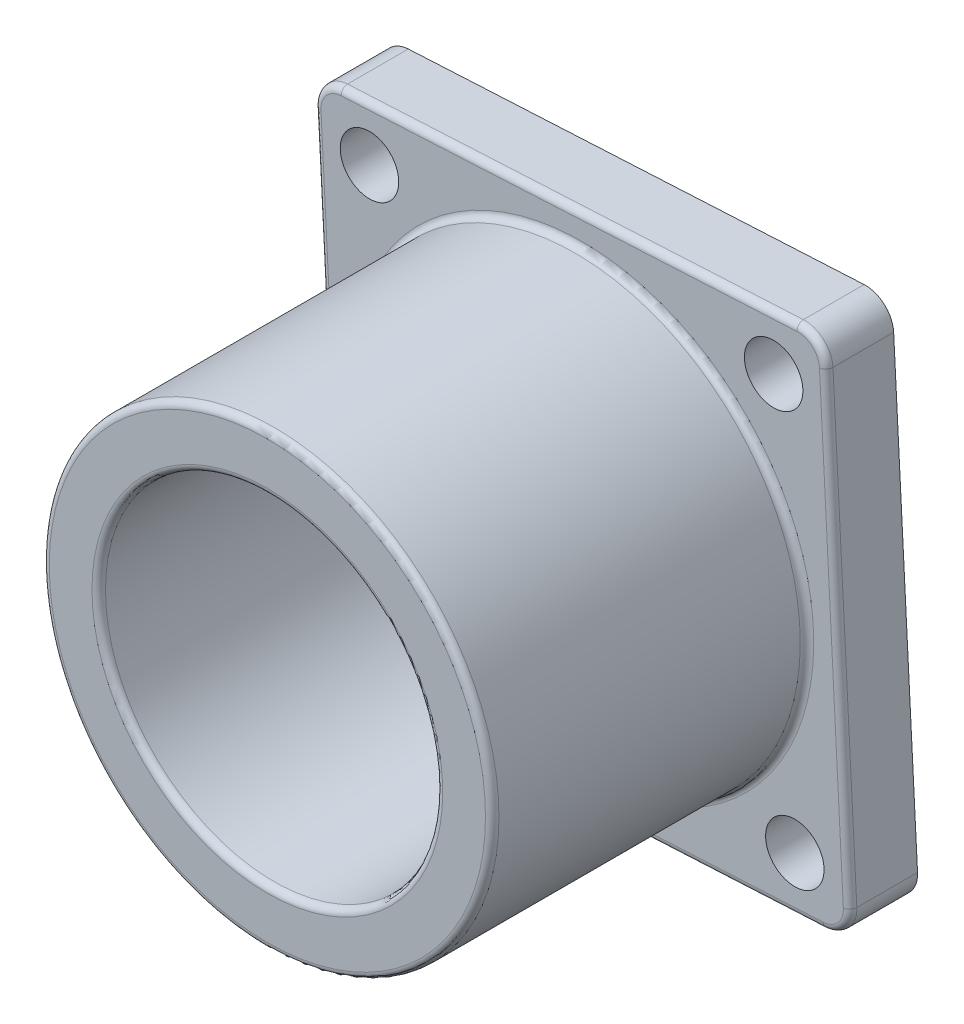
ISO-10303-21;
HEADER;
FILE_DESCRIPTION(('STEP AP214'),'2;1');
FILE_NAME('part.step','',(''),(''),'','','');
FILE_SCHEMA(('AUTOMOTIVE_DESIGN { 1 0 10303 214 1 1 1 1 }'));
ENDSEC;
DATA;
#1=APPLICATION_CONTEXT('core data for automotive mechanical design processes');
#2=APPLICATION_PROTOCOL_DEFINITION('international standard','automotive_design',2000,#1);
#3=PRODUCT_CONTEXT('',#1,'mechanical');
#4=PRODUCT('Part','Part','',(#3));
#5=PRODUCT_RELATED_PRODUCT_CATEGORY('part','',(#4));
#6=PRODUCT_DEFINITION_FORMATION('','',#4);
#7=PRODUCT_DEFINITION_CONTEXT('part definition',#1,'design');
#8=PRODUCT_DEFINITION('design','',#6,#7);
#9=PRODUCT_DEFINITION_SHAPE('','',#8);
#10=(LENGTH_UNIT() NAMED_UNIT(*) SI_UNIT(.MILLI.,.METRE.));
#11=(NAMED_UNIT(*) PLANE_ANGLE_UNIT() SI_UNIT($,.RADIAN.));
#12=(NAMED_UNIT(*) SI_UNIT($,.STERADIAN.) SOLID_ANGLE_UNIT());
#13=UNCERTAINTY_MEASURE_WITH_UNIT(LENGTH_MEASURE(1.E-05),#10,'distance_accuracy_value','');
#14=(GEOMETRIC_REPRESENTATION_CONTEXT(3) GLOBAL_UNCERTAINTY_ASSIGNED_CONTEXT((#13)) GLOBAL_UNIT_ASSIGNED_CONTEXT((#10,
#11,#12)) REPRESENTATION_CONTEXT('',''));
#15=CARTESIAN_POINT('',(0.,0.,0.));
#16=DIRECTION('',(0.,0.,1.));
#17=DIRECTION('',(1.,0.,0.));
#18=AXIS2_PLACEMENT_3D('',#15,#16,#17);
#19=CARTESIAN_POINT('',(76.708,-123.825,23.1775));
#20=DIRECTION('',(0.,0.,-1.));
#21=DIRECTION('',(-1.,0.,0.));
#22=AXIS2_PLACEMENT_3D('',#19,#20,#21);
#23=CYLINDRICAL_SURFACE('',#22,9.525);
#24=CARTESIAN_POINT('',(76.708,-123.825,1.5875));
#25=DIRECTION('',(0.,0.,-1.));
#26=DIRECTION('',(-1.,0.,0.));
#27=AXIS2_PLACEMENT_3D('',#24,#25,#26);
#28=CIRCLE('',#27,9.525);
#29=CARTESIAN_POINT('',(67.183,-123.825,1.5875));
#30=VERTEX_POINT('',#29);
#31=EDGE_CURVE('E246',#30,#30,#28,.T.);
#32=ORIENTED_EDGE('',*,*,#31,.T.);
#33=EDGE_LOOP('',(#32));
#34=FACE_BOUND('',#33,.T.);
#35=CARTESIAN_POINT('',(76.708,-123.825,22.7965));
#36=DIRECTION('',(0.,0.,-1.));
#37=DIRECTION('',(-1.,0.,0.));
#38=AXIS2_PLACEMENT_3D('',#35,#36,#37);
#39=CIRCLE('',#38,9.52499999999999);
#40=CARTESIAN_POINT('',(67.183,-123.825,22.7965));
#41=VERTEX_POINT('',#40);
#42=EDGE_CURVE('E146',#41,#41,#39,.T.);
#43=ORIENTED_EDGE('',*,*,#42,.F.);
#44=EDGE_LOOP('',(#43));
#45=FACE_BOUND('',#44,.T.);
#46=ADVANCED_FACE('F16',(#34,#45),#23,.F.);
#47=CARTESIAN_POINT('',(88.9061973738044,-110.277529338296,1.5875));
#48=DIRECTION('',(0.,0.,1.));
#49=DIRECTION('',(1.,0.,0.));
#50=AXIS2_PLACEMENT_3D('',#47,#48,#49);
#51=CYLINDRICAL_SURFACE('',#50,1.5875);
#52=CARTESIAN_POINT('',(88.9061973738044,-110.277529338296,1.5875));
#53=DIRECTION('',(0.,0.,1.));
#54=DIRECTION('',(1.,0.,0.));
#55=AXIS2_PLACEMENT_3D('',#52,#53,#54);
#56=CIRCLE('',#55,1.5875);
#57=CARTESIAN_POINT('',(90.4915217602272,-110.194446007761,1.5875));
#58=VERTEX_POINT('',#57);
#59=CARTESIAN_POINT('',(88.8231140432686,-108.692204951874,1.5875));
#60=VERTEX_POINT('',#59);
#61=EDGE_CURVE('E253',#58,#60,#56,.T.);
#62=ORIENTED_EDGE('',*,*,#61,.T.);
#63=DIRECTION('',(0.,0.,1.));
#64=VECTOR('',#63,1.);
#65=CARTESIAN_POINT('',(88.8231140432685,-108.692204951874,1.5875));
#66=LINE('',#65,#64);
#67=CARTESIAN_POINT('',(88.8231140432686,-108.692204951874,5.0165));
#68=VERTEX_POINT('',#67);
#69=EDGE_CURVE('E207',#68,#60,#66,.F.);
#70=ORIENTED_EDGE('',*,*,#69,.F.);
#71=CARTESIAN_POINT('',(88.9061973738044,-110.277529338296,5.0165));
#72=DIRECTION('',(0.,0.,-1.));
#73=DIRECTION('',(-1.,0.,0.));
#74=AXIS2_PLACEMENT_3D('',#71,#72,#73);
#75=CIRCLE('',#74,1.58750000000001);
#76=CARTESIAN_POINT('',(90.4915217602272,-110.194446007761,5.0165));
#77=VERTEX_POINT('',#76);
#78=EDGE_CURVE('E142',#77,#68,#75,.F.);
#79=ORIENTED_EDGE('',*,*,#78,.F.);
#80=DIRECTION('',(0.,0.,1.));
#81=VECTOR('',#80,1.);
#82=CARTESIAN_POINT('',(90.4915217602272,-110.194446007761,1.5875));
#83=LINE('',#82,#81);
#84=EDGE_CURVE('E141',#58,#77,#83,.T.);
#85=ORIENTED_EDGE('',*,*,#84,.F.);
#86=EDGE_LOOP('',(#62,#70,#79,#85));
#87=FACE_BOUND('',#86,.T.);
#88=ADVANCED_FACE('F724',(#87),#51,.T.);
#89=CARTESIAN_POINT('',(90.4084384296914,-108.609121621338,1.5875));
#90=DIRECTION('',(-0.0523359562429433,0.998629534754574,0.));
#91=DIRECTION('',(-0.998629534754574,-0.0523359562429433,0.));
#92=AXIS2_PLACEMENT_3D('',#89,#90,#91);
#93=PLANE('',#92);
#94=DIRECTION('',(-0.998629534754574,-0.0523359562429448,0.));
#95=VECTOR('',#94,1.);
#96=CARTESIAN_POINT('',(88.8231140432685,-108.692204951874,1.5875));
#97=LINE('',#96,#95);
#98=CARTESIAN_POINT('',(63.0774460077605,-110.041478239773,1.5875));
#99=VERTEX_POINT('',#98);
#100=EDGE_CURVE('E252',#60,#99,#97,.T.);
#101=ORIENTED_EDGE('',*,*,#100,.T.);
#102=DIRECTION('',(0.,0.,1.));
#103=VECTOR('',#102,1.);
#104=CARTESIAN_POINT('',(63.0774460077604,-110.041478239773,1.5875));
#105=LINE('',#104,#103);
#106=CARTESIAN_POINT('',(63.0774460077603,-110.041478239773,5.0165));
#107=VERTEX_POINT('',#106);
#108=EDGE_CURVE('E196',#107,#99,#105,.F.);
#109=ORIENTED_EDGE('',*,*,#108,.F.);
#110=DIRECTION('',(-0.998629534754574,-0.0523359562429433,0.));
#111=VECTOR('',#110,1.);
#112=CARTESIAN_POINT('',(83.179359227603,-108.987981608581,5.0165));
#113=LINE('',#112,#111);
#114=EDGE_CURVE('E210',#68,#107,#113,.T.);
#115=ORIENTED_EDGE('',*,*,#114,.F.);
#116=ORIENTED_EDGE('',*,*,#69,.T.);
#117=EDGE_LOOP('',(#101,#109,#115,#116));
#118=FACE_BOUND('',#117,.T.);
#119=ADVANCED_FACE('F263',(#118),#93,.T.);
#120=CARTESIAN_POINT('',(63.1605293382962,-111.626802626196,1.5875));
#121=DIRECTION('',(0.,0.,1.));
#122=DIRECTION('',(1.,0.,0.));
#123=AXIS2_PLACEMENT_3D('',#120,#121,#122);
#124=CYLINDRICAL_SURFACE('',#123,1.5875);
#125=CARTESIAN_POINT('',(63.1605293382962,-111.626802626196,1.5875));
#126=DIRECTION('',(0.,0.,1.));
#127=DIRECTION('',(1.,0.,0.));
#128=AXIS2_PLACEMENT_3D('',#125,#126,#127);
#129=CIRCLE('',#128,1.5875);
#130=CARTESIAN_POINT('',(61.5752049518732,-111.709885956731,1.5875));
#131=VERTEX_POINT('',#130);
#132=EDGE_CURVE('E249',#99,#131,#129,.T.);
#133=ORIENTED_EDGE('',*,*,#132,.T.);
#134=DIRECTION('',(0.,0.,1.));
#135=VECTOR('',#134,1.);
#136=CARTESIAN_POINT('',(61.5752049518732,-111.709885956731,1.5875));
#137=LINE('',#136,#135);
#138=CARTESIAN_POINT('',(61.5752049518732,-111.709885956731,5.0165));
#139=VERTEX_POINT('',#138);
#140=EDGE_CURVE('E186',#139,#131,#137,.F.);
#141=ORIENTED_EDGE('',*,*,#140,.F.);
#142=CARTESIAN_POINT('',(63.1605293382962,-111.626802626196,5.0165));
#143=DIRECTION('',(0.,0.,-1.));
#144=DIRECTION('',(-1.,0.,0.));
#145=AXIS2_PLACEMENT_3D('',#142,#143,#144);
#146=CIRCLE('',#145,1.5875);
#147=EDGE_CURVE('E199',#107,#139,#146,.F.);
#148=ORIENTED_EDGE('',*,*,#147,.F.);
#149=ORIENTED_EDGE('',*,*,#108,.T.);
#150=EDGE_LOOP('',(#133,#141,#148,#149));
#151=FACE_BOUND('',#150,.T.);
#152=ADVANCED_FACE('F267',(#151),#124,.T.);
#153=CARTESIAN_POINT('',(61.4921216213378,-110.124561570309,1.5875));
#154=DIRECTION('',(-0.998629534754582,-0.0523359562427955,0.));
#155=DIRECTION('',(0.0523359562427955,-0.998629534754582,0.));
#156=AXIS2_PLACEMENT_3D('',#153,#154,#155);
#157=PLANE('',#156);
#158=DIRECTION('',(0.052335956242798,-0.998629534754581,0.));
#159=VECTOR('',#158,1.);
#160=CARTESIAN_POINT('',(61.5752049518731,-111.709885956731,1.5875));
#161=LINE('',#160,#159);
#162=CARTESIAN_POINT('',(62.9244782397687,-137.455553992239,1.5875));
#163=VERTEX_POINT('',#162);
#164=EDGE_CURVE('E107',#131,#163,#161,.T.);
#165=ORIENTED_EDGE('',*,*,#164,.T.);
#166=DIRECTION('',(0.,0.,1.));
#167=VECTOR('',#166,1.);
#168=CARTESIAN_POINT('',(62.9244782397687,-137.455553992239,1.5875));
#169=LINE('',#168,#167);
#170=CARTESIAN_POINT('',(62.9244782397687,-137.455553992239,5.0165));
#171=VERTEX_POINT('',#170);
#172=EDGE_CURVE('E117',#171,#163,#169,.F.);
#173=ORIENTED_EDGE('',*,*,#172,.F.);
#174=DIRECTION('',(0.0523359562427955,-0.998629534754582,0.));
#175=VECTOR('',#174,1.);
#176=CARTESIAN_POINT('',(61.8709816085793,-117.353640772396,5.0165));
#177=LINE('',#176,#175);
#178=EDGE_CURVE('E189',#139,#171,#177,.T.);
#179=ORIENTED_EDGE('',*,*,#178,.F.);
#180=ORIENTED_EDGE('',*,*,#140,.T.);
#181=EDGE_LOOP('',(#165,#173,#179,#180));
#182=FACE_BOUND('',#181,.T.);
#183=ADVANCED_FACE('F470',(#182),#157,.T.);
#184=CARTESIAN_POINT('',(64.5098026261916,-137.372470661704,1.5875));
#185=DIRECTION('',(0.,0.,1.));
#186=DIRECTION('',(1.,0.,0.));
#187=AXIS2_PLACEMENT_3D('',#184,#185,#186);
#188=CYLINDRICAL_SURFACE('',#187,1.5875);
#189=CARTESIAN_POINT('',(64.5098026261916,-137.372470661704,1.5875));
#190=DIRECTION('',(0.,0.,1.));
#191=DIRECTION('',(1.,0.,0.));
#192=AXIS2_PLACEMENT_3D('',#189,#190,#191);
#193=CIRCLE('',#192,1.5875);
#194=CARTESIAN_POINT('',(64.5928859567273,-138.957795048127,1.5875));
#195=VERTEX_POINT('',#194);
#196=EDGE_CURVE('E19',#163,#195,#193,.T.);
#197=ORIENTED_EDGE('',*,*,#196,.T.);
#198=DIRECTION('',(0.,0.,1.));
#199=VECTOR('',#198,1.);
#200=CARTESIAN_POINT('',(64.5928859567274,-138.957795048127,1.5875));
#201=LINE('',#200,#199);
#202=CARTESIAN_POINT('',(64.5928859567273,-138.957795048127,5.0165));
#203=VERTEX_POINT('',#202);
#204=EDGE_CURVE('E115',#203,#195,#201,.F.);
#205=ORIENTED_EDGE('',*,*,#204,.F.);
#206=CARTESIAN_POINT('',(64.5098026261916,-137.372470661704,5.0165));
#207=DIRECTION('',(0.,0.,-1.));
#208=DIRECTION('',(-1.,0.,0.));
#209=AXIS2_PLACEMENT_3D('',#206,#207,#208);
#210=CIRCLE('',#209,1.58750000000001);
#211=EDGE_CURVE('E180',#171,#203,#210,.F.);
#212=ORIENTED_EDGE('',*,*,#211,.F.);
#213=ORIENTED_EDGE('',*,*,#172,.T.);
#214=EDGE_LOOP('',(#197,#205,#212,#213));
#215=FACE_BOUND('',#214,.T.);
#216=ADVANCED_FACE('F113',(#215),#188,.T.);
#217=CARTESIAN_POINT('',(63.0075615703043,-139.040878378662,1.5875));
#218=DIRECTION('',(0.052335956242946,-0.998629534754574,0.));
#219=DIRECTION('',(0.998629534754574,0.052335956242946,0.));
#220=AXIS2_PLACEMENT_3D('',#217,#218,#219);
#221=PLANE('',#220);
#222=DIRECTION('',(0.998629534754574,0.0523359562429467,0.));
#223=VECTOR('',#222,1.);
#224=CARTESIAN_POINT('',(64.5928859567274,-138.957795048127,1.5875));
#225=LINE('',#224,#223);
#226=CARTESIAN_POINT('',(90.3385539922394,-137.608521760227,1.5875));
#227=VERTEX_POINT('',#226);
#228=EDGE_CURVE('E120',#195,#227,#225,.T.);
#229=ORIENTED_EDGE('',*,*,#228,.T.);
#230=DIRECTION('',(0.,0.,1.));
#231=VECTOR('',#230,1.);
#232=CARTESIAN_POINT('',(90.3385539922393,-137.608521760227,1.5875));
#233=LINE('',#232,#231);
#234=CARTESIAN_POINT('',(90.3385539922394,-137.608521760227,5.0165));
#235=VERTEX_POINT('',#234);
#236=EDGE_CURVE('E128',#235,#227,#233,.F.);
#237=ORIENTED_EDGE('',*,*,#236,.F.);
#238=DIRECTION('',(0.998629534754574,0.052335956242946,0.));
#239=VECTOR('',#238,1.);
#240=CARTESIAN_POINT('',(70.2366407723947,-138.662018391419,5.0165));
#241=LINE('',#240,#239);
#242=EDGE_CURVE('E126',#203,#235,#241,.T.);
#243=ORIENTED_EDGE('',*,*,#242,.F.);
#244=ORIENTED_EDGE('',*,*,#204,.T.);
#245=EDGE_LOOP('',(#229,#237,#243,#244));
#246=FACE_BOUND('',#245,.T.);
#247=ADVANCED_FACE('F123',(#246),#221,.T.);
#248=CARTESIAN_POINT('',(90.2554706617037,-136.023197373804,1.5875));
#249=DIRECTION('',(0.,0.,1.));
#250=DIRECTION('',(1.,0.,0.));
#251=AXIS2_PLACEMENT_3D('',#248,#249,#250);
#252=CYLINDRICAL_SURFACE('',#251,1.5875);
#253=CARTESIAN_POINT('',(90.2554706617037,-136.023197373804,1.5875));
#254=DIRECTION('',(0.,0.,1.));
#255=DIRECTION('',(1.,0.,0.));
#256=AXIS2_PLACEMENT_3D('',#253,#254,#255);
#257=CIRCLE('',#256,1.5875);
#258=CARTESIAN_POINT('',(91.8407950481266,-135.940114043268,1.5875));
#259=VERTEX_POINT('',#258);
#260=EDGE_CURVE('E134',#227,#259,#257,.T.);
#261=ORIENTED_EDGE('',*,*,#260,.T.);
#262=DIRECTION('',(0.,0.,1.));
#263=VECTOR('',#262,1.);
#264=CARTESIAN_POINT('',(91.8407950481265,-135.940114043269,1.5875));
#265=LINE('',#264,#263);
#266=CARTESIAN_POINT('',(91.8407950481265,-135.940114043268,5.0165));
#267=VERTEX_POINT('',#266);
#268=EDGE_CURVE('E158',#267,#259,#265,.F.);
#269=ORIENTED_EDGE('',*,*,#268,.F.);
#270=CARTESIAN_POINT('',(90.2554706617037,-136.023197373804,5.0165));
#271=DIRECTION('',(0.,0.,-1.));
#272=DIRECTION('',(0.74314482547739,-0.669130606358863,0.));
#273=AXIS2_PLACEMENT_3D('',#270,#271,#272);
#274=CIRCLE('',#273,1.58750000000002);
#275=EDGE_CURVE('E165',#235,#267,#274,.F.);
#276=ORIENTED_EDGE('',*,*,#275,.F.);
#277=ORIENTED_EDGE('',*,*,#236,.T.);
#278=EDGE_LOOP('',(#261,#269,#276,#277));
#279=FACE_BOUND('',#278,.T.);
#280=ADVANCED_FACE('F687',(#279),#252,.T.);
#281=CARTESIAN_POINT('',(91.9238783786622,-137.525438429691,1.5875));
#282=DIRECTION('',(0.998629534754574,0.0523359562429438,0.));
#283=DIRECTION('',(-0.0523359562429438,0.998629534754574,0.));
#284=AXIS2_PLACEMENT_3D('',#281,#282,#283);
#285=PLANE('',#284);
#286=DIRECTION('',(-0.0523359562429458,0.998629534754574,0.));
#287=VECTOR('',#286,1.);
#288=CARTESIAN_POINT('',(91.8407950481266,-135.940114043269,1.5875));
#289=LINE('',#288,#287);
#290=EDGE_CURVE('E136',#259,#58,#289,.T.);
#291=ORIENTED_EDGE('',*,*,#290,.T.);
#292=ORIENTED_EDGE('',*,*,#84,.T.);
#293=DIRECTION('',(-0.0523359562429438,0.998629534754574,0.));
#294=VECTOR('',#293,1.);
#295=CARTESIAN_POINT('',(91.5450183914194,-130.296359227603,5.0165));
#296=LINE('',#295,#294);
#297=EDGE_CURVE('E149',#267,#77,#296,.T.);
#298=ORIENTED_EDGE('',*,*,#297,.F.);
#299=ORIENTED_EDGE('',*,*,#268,.T.);
#300=EDGE_LOOP('',(#291,#292,#298,#299));
#301=FACE_BOUND('',#300,.T.);
#302=ADVANCED_FACE('F258',(#301),#285,.T.);
#303=CARTESIAN_POINT('',(76.708,-123.825,1.5875));
#304=DIRECTION('',(0.,0.,1.));
#305=DIRECTION('',(1.,0.,0.));
#306=AXIS2_PLACEMENT_3D('',#303,#304,#305);
#307=PLANE('',#306);
#308=ORIENTED_EDGE('',*,*,#31,.F.);
#309=EDGE_LOOP('',(#308));
#310=FACE_BOUND('',#309,.T.);
#311=CARTESIAN_POINT('',(88.7205355621015,-134.641135602388,1.5875));
#312=DIRECTION('',(0.,0.,-1.));
#313=DIRECTION('',(-1.,0.,0.));
#314=AXIS2_PLACEMENT_3D('',#311,#312,#313);
#315=CIRCLE('',#314,1.65100000000001);
#316=CARTESIAN_POINT('',(87.0695355621015,-134.641135602388,1.5875));
#317=VERTEX_POINT('',#316);
#318=EDGE_CURVE('E233',#317,#317,#315,.F.);
#319=ORIENTED_EDGE('',*,*,#318,.T.);
#320=EDGE_LOOP('',(#319));
#321=FACE_BOUND('',#320,.T.);
#322=CARTESIAN_POINT('',(65.8918643976101,-135.8375355621,1.5875));
#323=DIRECTION('',(0.,0.,-1.));
#324=DIRECTION('',(-1.,0.,0.));
#325=AXIS2_PLACEMENT_3D('',#322,#323,#324);
#326=CIRCLE('',#325,1.651);
#327=CARTESIAN_POINT('',(64.2408643976101,-135.8375355621,1.5875));
#328=VERTEX_POINT('',#327);
#329=EDGE_CURVE('E237',#328,#328,#326,.F.);
#330=ORIENTED_EDGE('',*,*,#329,.T.);
#331=EDGE_LOOP('',(#330));
#332=FACE_BOUND('',#331,.T.);
#333=CARTESIAN_POINT('',(87.5241356023876,-111.812464437898,1.5875));
#334=DIRECTION('',(0.,0.,-1.));
#335=DIRECTION('',(-1.,0.,0.));
#336=AXIS2_PLACEMENT_3D('',#333,#334,#335);
#337=CIRCLE('',#336,1.65100000000001);
#338=CARTESIAN_POINT('',(85.8731356023876,-111.812464437898,1.5875));
#339=VERTEX_POINT('',#338);
#340=EDGE_CURVE('E240',#339,#339,#337,.F.);
#341=ORIENTED_EDGE('',*,*,#340,.T.);
#342=EDGE_LOOP('',(#341));
#343=FACE_BOUND('',#342,.T.);
#344=CARTESIAN_POINT('',(64.6954644378985,-113.008864397612,1.5875));
#345=DIRECTION('',(0.,0.,-1.));
#346=DIRECTION('',(-1.,0.,0.));
#347=AXIS2_PLACEMENT_3D('',#344,#345,#346);
#348=CIRCLE('',#347,1.651);
#349=CARTESIAN_POINT('',(63.0444644378984,-113.008864397612,1.5875));
#350=VERTEX_POINT('',#349);
#351=EDGE_CURVE('E243',#350,#350,#348,.F.);
#352=ORIENTED_EDGE('',*,*,#351,.T.);
#353=EDGE_LOOP('',(#352));
#354=FACE_BOUND('',#353,.T.);
#355=ORIENTED_EDGE('',*,*,#100,.F.);
#356=ORIENTED_EDGE('',*,*,#61,.F.);
#357=ORIENTED_EDGE('',*,*,#290,.F.);
#358=ORIENTED_EDGE('',*,*,#260,.F.);
#359=ORIENTED_EDGE('',*,*,#228,.F.);
#360=ORIENTED_EDGE('',*,*,#196,.F.);
#361=ORIENTED_EDGE('',*,*,#164,.F.);
#362=ORIENTED_EDGE('',*,*,#132,.F.);
#363=EDGE_LOOP('',(#355,#356,#357,#358,#359,#360,#361,#362));
#364=FACE_BOUND('',#363,.T.);
#365=ADVANCED_FACE('F132',(#310,#321,#332,#343,#354,#364),#307,.F.);
#366=CARTESIAN_POINT('',(76.708,-123.825,22.7965));
#367=DIRECTION('',(0.,0.,-1.));
#368=DIRECTION('',(-1.,0.,0.));
#369=AXIS2_PLACEMENT_3D('',#366,#367,#368);
#370=TOROIDAL_SURFACE('',#369,9.906,0.381);
#371=ORIENTED_EDGE('',*,*,#42,.T.);
#372=EDGE_LOOP('',(#371));
#373=FACE_BOUND('',#372,.T.);
#374=CARTESIAN_POINT('',(76.708,-123.825,23.1775));
#375=DIRECTION('',(0.,0.,1.));
#376=DIRECTION('',(1.,0.,0.));
#377=AXIS2_PLACEMENT_3D('',#374,#375,#376);
#378=CIRCLE('',#377,9.906);
#379=CARTESIAN_POINT('',(86.614,-123.825,23.1775));
#380=VERTEX_POINT('',#379);
#381=EDGE_CURVE('E236',#380,#380,#378,.F.);
#382=ORIENTED_EDGE('',*,*,#381,.F.);
#383=EDGE_LOOP('',(#382));
#384=FACE_BOUND('',#383,.T.);
#385=ADVANCED_FACE('F301',(#373,#384),#370,.T.);
#386=CARTESIAN_POINT('',(88.9061973738044,-110.277529338296,5.0165));
#387=DIRECTION('',(0.,0.,-1.));
#388=DIRECTION('',(-1.,0.,0.));
#389=AXIS2_PLACEMENT_3D('',#386,#387,#388);
#390=TOROIDAL_SURFACE('',#389,1.2065,0.381);
#391=CARTESIAN_POINT('',(90.1110439074856,-110.214386007089,5.0165));
#392=DIRECTION('',(-0.0523359562429438,0.998629534754574,0.));
#393=DIRECTION('',(-0.998629534754574,-0.0523359562429438,0.));
#394=AXIS2_PLACEMENT_3D('',#391,#392,#393);
#395=CIRCLE('',#394,0.381);
#396=CARTESIAN_POINT('',(90.1110439074857,-110.214386007089,5.3975));
#397=VERTEX_POINT('',#396);
#398=EDGE_CURVE('E152',#77,#397,#395,.F.);
#399=ORIENTED_EDGE('',*,*,#398,.F.);
#400=ORIENTED_EDGE('',*,*,#78,.T.);
#401=CARTESIAN_POINT('',(88.8430540425972,-109.072682804615,5.0165));
#402=DIRECTION('',(-0.998629534754574,-0.0523359562429433,0.));
#403=DIRECTION('',(0.0523359562429433,-0.998629534754574,0.));
#404=AXIS2_PLACEMENT_3D('',#401,#402,#403);
#405=CIRCLE('',#404,0.381);
#406=CARTESIAN_POINT('',(88.8430540425972,-109.072682804615,5.3975));
#407=VERTEX_POINT('',#406);
#408=EDGE_CURVE('E145',#407,#68,#405,.T.);
#409=ORIENTED_EDGE('',*,*,#408,.F.);
#410=CARTESIAN_POINT('',(88.9061973738044,-110.277529338296,5.3975));
#411=DIRECTION('',(0.,0.,-1.));
#412=DIRECTION('',(-0.0523359562430201,0.99862953475457,0.));
#413=AXIS2_PLACEMENT_3D('',#410,#411,#412);
#414=CIRCLE('',#413,1.20649999999997);
#415=EDGE_CURVE('E330',#397,#407,#414,.F.);
#416=ORIENTED_EDGE('',*,*,#415,.F.);
#417=EDGE_LOOP('',(#399,#400,#409,#416));
#418=FACE_BOUND('',#417,.T.);
#419=ADVANCED_FACE('F295',(#418),#390,.T.);
#420=CARTESIAN_POINT('',(83.1992992269316,-109.368459461322,5.0165));
#421=DIRECTION('',(-0.998629534754574,-0.0523359562429433,0.));
#422=DIRECTION('',(0.0523359562429433,-0.998629534754574,0.));
#423=AXIS2_PLACEMENT_3D('',#420,#421,#422);
#424=CYLINDRICAL_SURFACE('',#423,0.381);
#425=ORIENTED_EDGE('',*,*,#408,.T.);
#426=ORIENTED_EDGE('',*,*,#114,.T.);
#427=CARTESIAN_POINT('',(63.0973860070889,-110.421956092515,5.0165));
#428=DIRECTION('',(0.998629534754563,0.0523359562431584,0.));
#429=DIRECTION('',(-0.0523359562431584,0.998629534754563,0.));
#430=AXIS2_PLACEMENT_3D('',#427,#428,#429);
#431=CIRCLE('',#430,0.381);
#432=CARTESIAN_POINT('',(63.0973860070889,-110.421956092514,5.3975));
#433=VERTEX_POINT('',#432);
#434=EDGE_CURVE('E202',#433,#107,#431,.F.);
#435=ORIENTED_EDGE('',*,*,#434,.F.);
#436=DIRECTION('',(-0.998629534754574,-0.0523359562429443,0.));
#437=VECTOR('',#436,1.);
#438=CARTESIAN_POINT('',(88.8430540425972,-109.072682804615,5.3975));
#439=LINE('',#438,#437);
#440=EDGE_CURVE('E332',#407,#433,#439,.T.);
#441=ORIENTED_EDGE('',*,*,#440,.F.);
#442=EDGE_LOOP('',(#425,#426,#435,#441));
#443=FACE_BOUND('',#442,.T.);
#444=ADVANCED_FACE('F300',(#443),#424,.T.);
#445=CARTESIAN_POINT('',(63.1605293382962,-111.626802626196,5.0165));
#446=DIRECTION('',(0.,0.,-1.));
#447=DIRECTION('',(-1.,0.,0.));
#448=AXIS2_PLACEMENT_3D('',#445,#446,#447);
#449=TOROIDAL_SURFACE('',#448,1.2065,0.381);
#450=CARTESIAN_POINT('',(61.9556828046146,-111.689945957403,5.0165));
#451=DIRECTION('',(0.0523359562427955,-0.998629534754582,0.));
#452=DIRECTION('',(0.998629534754582,0.0523359562427955,0.));
#453=AXIS2_PLACEMENT_3D('',#450,#451,#452);
#454=CIRCLE('',#453,0.381);
#455=CARTESIAN_POINT('',(61.9556828046147,-111.689945957403,5.3975));
#456=VERTEX_POINT('',#455);
#457=EDGE_CURVE('E192',#456,#139,#454,.T.);
#458=ORIENTED_EDGE('',*,*,#457,.F.);
#459=CARTESIAN_POINT('',(63.1605293382962,-111.626802626196,5.3975));
#460=DIRECTION('',(0.,0.,-1.));
#461=DIRECTION('',(-0.998629534754586,-0.0523359562427044,0.));
#462=AXIS2_PLACEMENT_3D('',#459,#460,#461);
#463=CIRCLE('',#462,1.20650000000009);
#464=EDGE_CURVE('E274',#433,#456,#463,.F.);
#465=ORIENTED_EDGE('',*,*,#464,.F.);
#466=ORIENTED_EDGE('',*,*,#434,.T.);
#467=ORIENTED_EDGE('',*,*,#147,.T.);
#468=EDGE_LOOP('',(#458,#465,#466,#467));
#469=FACE_BOUND('',#468,.T.);
#470=ADVANCED_FACE('F272',(#469),#449,.T.);
#471=CARTESIAN_POINT('',(62.2514594613208,-117.333700773068,5.0165));
#472=DIRECTION('',(0.0523359562427955,-0.998629534754582,0.));
#473=DIRECTION('',(0.998629534754582,0.0523359562427955,0.));
#474=AXIS2_PLACEMENT_3D('',#471,#472,#473);
#475=CYLINDRICAL_SURFACE('',#474,0.381);
#476=CARTESIAN_POINT('',(63.3049560925102,-137.435613992911,5.0165));
#477=DIRECTION('',(-0.0523359562427351,0.998629534754585,0.));
#478=DIRECTION('',(-0.998629534754585,-0.052335956242735,0.));
#479=AXIS2_PLACEMENT_3D('',#476,#477,#478);
#480=CIRCLE('',#479,0.381);
#481=CARTESIAN_POINT('',(63.3049560925102,-137.435613992911,5.3975));
#482=VERTEX_POINT('',#481);
#483=EDGE_CURVE('E182',#482,#171,#480,.F.);
#484=ORIENTED_EDGE('',*,*,#483,.F.);
#485=DIRECTION('',(0.0523359562427977,-0.998629534754581,0.));
#486=VECTOR('',#485,1.);
#487=CARTESIAN_POINT('',(61.9556828046147,-111.689945957403,5.3975));
#488=LINE('',#487,#486);
#489=EDGE_CURVE('E337',#456,#482,#488,.T.);
#490=ORIENTED_EDGE('',*,*,#489,.F.);
#491=ORIENTED_EDGE('',*,*,#457,.T.);
#492=ORIENTED_EDGE('',*,*,#178,.T.);
#493=EDGE_LOOP('',(#484,#490,#491,#492));
#494=FACE_BOUND('',#493,.T.);
#495=ADVANCED_FACE('F457',(#494),#475,.T.);
#496=CARTESIAN_POINT('',(64.5098026261916,-137.372470661704,5.0165));
#497=DIRECTION('',(0.,0.,-1.));
#498=DIRECTION('',(-1.,0.,0.));
#499=AXIS2_PLACEMENT_3D('',#496,#497,#498);
#500=TOROIDAL_SURFACE('',#499,1.2065,0.381);
#501=CARTESIAN_POINT('',(64.5729459573987,-138.577317195385,5.0165));
#502=DIRECTION('',(0.998629534754574,0.052335956242946,0.));
#503=DIRECTION('',(-0.052335956242946,0.998629534754574,0.));
#504=AXIS2_PLACEMENT_3D('',#501,#502,#503);
#505=CIRCLE('',#504,0.381);
#506=CARTESIAN_POINT('',(64.5729459573987,-138.577317195385,5.3975));
#507=VERTEX_POINT('',#506);
#508=EDGE_CURVE('E175',#507,#203,#505,.T.);
#509=ORIENTED_EDGE('',*,*,#508,.F.);
#510=CARTESIAN_POINT('',(64.5098026261916,-137.372470661704,5.3975));
#511=DIRECTION('',(0.,0.,-1.));
#512=DIRECTION('',(0.052335956243066,-0.998629534754568,0.));
#513=AXIS2_PLACEMENT_3D('',#510,#511,#512);
#514=CIRCLE('',#513,1.20649999999997);
#515=EDGE_CURVE('E427',#482,#507,#514,.F.);
#516=ORIENTED_EDGE('',*,*,#515,.F.);
#517=ORIENTED_EDGE('',*,*,#483,.T.);
#518=ORIENTED_EDGE('',*,*,#211,.T.);
#519=EDGE_LOOP('',(#509,#516,#517,#518));
#520=FACE_BOUND('',#519,.T.);
#521=ADVANCED_FACE('F437',(#520),#500,.T.);
#522=CARTESIAN_POINT('',(70.2167007730661,-138.281540538678,5.0165));
#523=DIRECTION('',(0.998629534754574,0.052335956242946,0.));
#524=DIRECTION('',(-0.052335956242946,0.998629534754574,0.));
#525=AXIS2_PLACEMENT_3D('',#522,#523,#524);
#526=CYLINDRICAL_SURFACE('',#525,0.381);
#527=CARTESIAN_POINT('',(90.3186139929109,-137.228043907485,5.0165));
#528=DIRECTION('',(-0.998629534754573,-0.0523359562429584,0.));
#529=DIRECTION('',(0.0523359562429661,-0.998629534754573,0.));
#530=AXIS2_PLACEMENT_3D('',#527,#528,#529);
#531=CIRCLE('',#530,0.381);
#532=CARTESIAN_POINT('',(90.3186139929109,-137.228043907486,5.3975));
#533=VERTEX_POINT('',#532);
#534=EDGE_CURVE('E168',#533,#235,#531,.F.);
#535=ORIENTED_EDGE('',*,*,#534,.F.);
#536=DIRECTION('',(0.998629534754574,0.0523359562429365,0.));
#537=VECTOR('',#536,1.);
#538=CARTESIAN_POINT('',(64.5729459573987,-138.577317195385,5.3975));
#539=LINE('',#538,#537);
#540=EDGE_CURVE('E424',#507,#533,#539,.T.);
#541=ORIENTED_EDGE('',*,*,#540,.F.);
#542=ORIENTED_EDGE('',*,*,#508,.T.);
#543=ORIENTED_EDGE('',*,*,#242,.T.);
#544=EDGE_LOOP('',(#535,#541,#542,#543));
#545=FACE_BOUND('',#544,.T.);
#546=ADVANCED_FACE('F456',(#545),#526,.T.);
#547=CARTESIAN_POINT('',(90.2554706617037,-136.023197373804,5.0165));
#548=DIRECTION('',(0.,0.,-1.));
#549=DIRECTION('',(0.743144825477388,-0.669130606358865,0.));
#550=AXIS2_PLACEMENT_3D('',#547,#548,#549);
#551=TOROIDAL_SURFACE('',#550,1.20650000000001,0.381);
#552=CARTESIAN_POINT('',(91.4603171953849,-135.960054042597,5.0165));
#553=DIRECTION('',(-0.0523359562429438,0.998629534754574,0.));
#554=DIRECTION('',(-0.998629534754574,-0.0523359562429438,0.));
#555=AXIS2_PLACEMENT_3D('',#552,#553,#554);
#556=CIRCLE('',#555,0.381);
#557=CARTESIAN_POINT('',(91.4603171953851,-135.960054042597,5.3975));
#558=VERTEX_POINT('',#557);
#559=EDGE_CURVE('E153',#558,#267,#556,.T.);
#560=ORIENTED_EDGE('',*,*,#559,.F.);
#561=CARTESIAN_POINT('',(90.2554706617037,-136.023197373804,5.3975));
#562=DIRECTION('',(0.,0.,-1.));
#563=DIRECTION('',(0.998629534754578,0.0523359562428698,0.));
#564=AXIS2_PLACEMENT_3D('',#561,#562,#563);
#565=CIRCLE('',#564,1.20649999999999);
#566=EDGE_CURVE('E421',#533,#558,#565,.F.);
#567=ORIENTED_EDGE('',*,*,#566,.F.);
#568=ORIENTED_EDGE('',*,*,#534,.T.);
#569=ORIENTED_EDGE('',*,*,#275,.T.);
#570=EDGE_LOOP('',(#560,#567,#568,#569));
#571=FACE_BOUND('',#570,.T.);
#572=ADVANCED_FACE('F517',(#571),#551,.T.);
#573=CARTESIAN_POINT('',(91.164540538678,-130.316299226932,5.0165));
#574=DIRECTION('',(-0.0523359562429438,0.998629534754574,0.));
#575=DIRECTION('',(-0.998629534754574,-0.0523359562429438,0.));
#576=AXIS2_PLACEMENT_3D('',#573,#574,#575);
#577=CYLINDRICAL_SURFACE('',#576,0.381);
#578=ORIENTED_EDGE('',*,*,#398,.T.);
#579=DIRECTION('',(-0.0523359562429458,0.998629534754574,0.));
#580=VECTOR('',#579,1.);
#581=CARTESIAN_POINT('',(91.4603171953851,-135.960054042597,5.3975));
#582=LINE('',#581,#580);
#583=EDGE_CURVE('E232',#558,#397,#582,.T.);
#584=ORIENTED_EDGE('',*,*,#583,.F.);
#585=ORIENTED_EDGE('',*,*,#559,.T.);
#586=ORIENTED_EDGE('',*,*,#297,.T.);
#587=EDGE_LOOP('',(#578,#584,#585,#586));
#588=FACE_BOUND('',#587,.T.);
#589=ADVANCED_FACE('F521',(#588),#577,.T.);
#590=CARTESIAN_POINT('',(64.6954644378985,-113.008864397612,5.3975));
#591=DIRECTION('',(0.,0.,-1.));
#592=DIRECTION('',(-1.,0.,0.));
#593=AXIS2_PLACEMENT_3D('',#590,#591,#592);
#594=CYLINDRICAL_SURFACE('',#593,1.651);
#595=ORIENTED_EDGE('',*,*,#351,.F.);
#596=EDGE_LOOP('',(#595));
#597=FACE_BOUND('',#596,.T.);
#598=CARTESIAN_POINT('',(64.6954644378985,-113.008864397612,5.3975));
#599=DIRECTION('',(0.,0.,-1.));
#600=DIRECTION('',(-1.,0.,0.));
#601=AXIS2_PLACEMENT_3D('',#598,#599,#600);
#602=CIRCLE('',#601,1.651);
#603=CARTESIAN_POINT('',(63.0444644378984,-113.008864397612,5.3975));
#604=VERTEX_POINT('',#603);
#605=EDGE_CURVE('E229',#604,#604,#602,.T.);
#606=ORIENTED_EDGE('',*,*,#605,.F.);
#607=EDGE_LOOP('',(#606));
#608=FACE_BOUND('',#607,.T.);
#609=ADVANCED_FACE('F576',(#597,#608),#594,.F.);
#610=CARTESIAN_POINT('',(87.5241356023876,-111.812464437898,5.3975));
#611=DIRECTION('',(0.,0.,-1.));
#612=DIRECTION('',(-1.,0.,0.));
#613=AXIS2_PLACEMENT_3D('',#610,#611,#612);
#614=CYLINDRICAL_SURFACE('',#613,1.65100000000001);
#615=ORIENTED_EDGE('',*,*,#340,.F.);
#616=EDGE_LOOP('',(#615));
#617=FACE_BOUND('',#616,.T.);
#618=CARTESIAN_POINT('',(87.5241356023876,-111.812464437898,5.3975));
#619=DIRECTION('',(0.,0.,-1.));
#620=DIRECTION('',(-1.,0.,0.));
#621=AXIS2_PLACEMENT_3D('',#618,#619,#620);
#622=CIRCLE('',#621,1.65100000000001);
#623=CARTESIAN_POINT('',(85.8731356023876,-111.812464437898,5.3975));
#624=VERTEX_POINT('',#623);
#625=EDGE_CURVE('E226',#624,#624,#622,.T.);
#626=ORIENTED_EDGE('',*,*,#625,.F.);
#627=EDGE_LOOP('',(#626));
#628=FACE_BOUND('',#627,.T.);
#629=ADVANCED_FACE('F582',(#617,#628),#614,.F.);
#630=CARTESIAN_POINT('',(65.8918643976101,-135.8375355621,5.3975));
#631=DIRECTION('',(0.,0.,-1.));
#632=DIRECTION('',(-1.,0.,0.));
#633=AXIS2_PLACEMENT_3D('',#630,#631,#632);
#634=CYLINDRICAL_SURFACE('',#633,1.651);
#635=ORIENTED_EDGE('',*,*,#329,.F.);
#636=EDGE_LOOP('',(#635));
#637=FACE_BOUND('',#636,.T.);
#638=CARTESIAN_POINT('',(65.8918643976101,-135.8375355621,5.3975));
#639=DIRECTION('',(0.,0.,-1.));
#640=DIRECTION('',(-1.,0.,0.));
#641=AXIS2_PLACEMENT_3D('',#638,#639,#640);
#642=CIRCLE('',#641,1.651);
#643=CARTESIAN_POINT('',(64.2408643976101,-135.8375355621,5.3975));
#644=VERTEX_POINT('',#643);
#645=EDGE_CURVE('E223',#644,#644,#642,.T.);
#646=ORIENTED_EDGE('',*,*,#645,.F.);
#647=EDGE_LOOP('',(#646));
#648=FACE_BOUND('',#647,.T.);
#649=ADVANCED_FACE('F589',(#637,#648),#634,.F.);
#650=CARTESIAN_POINT('',(88.7205355621015,-134.641135602388,5.3975));
#651=DIRECTION('',(0.,0.,-1.));
#652=DIRECTION('',(-1.,0.,0.));
#653=AXIS2_PLACEMENT_3D('',#650,#651,#652);
#654=CYLINDRICAL_SURFACE('',#653,1.65100000000001);
#655=ORIENTED_EDGE('',*,*,#318,.F.);
#656=EDGE_LOOP('',(#655));
#657=FACE_BOUND('',#656,.T.);
#658=CARTESIAN_POINT('',(88.7205355621015,-134.641135602388,5.3975));
#659=DIRECTION('',(0.,0.,-1.));
#660=DIRECTION('',(-1.,0.,0.));
#661=AXIS2_PLACEMENT_3D('',#658,#659,#660);
#662=CIRCLE('',#661,1.65100000000001);
#663=CARTESIAN_POINT('',(87.0695355621015,-134.641135602388,5.3975));
#664=VERTEX_POINT('',#663);
#665=EDGE_CURVE('E219',#664,#664,#662,.T.);
#666=ORIENTED_EDGE('',*,*,#665,.F.);
#667=EDGE_LOOP('',(#666));
#668=FACE_BOUND('',#667,.T.);
#669=ADVANCED_FACE('F597',(#657,#668),#654,.F.);
#670=CARTESIAN_POINT('',(76.708,-123.825,23.1775));
#671=DIRECTION('',(0.,0.,1.));
#672=DIRECTION('',(1.,0.,0.));
#673=AXIS2_PLACEMENT_3D('',#670,#671,#672);
#674=PLANE('',#673);
#675=ORIENTED_EDGE('',*,*,#381,.T.);
#676=EDGE_LOOP('',(#675));
#677=FACE_BOUND('',#676,.T.);
#678=CARTESIAN_POINT('',(76.708,-123.825,23.1775));
#679=DIRECTION('',(0.,0.,-1.));
#680=DIRECTION('',(1.,0.,0.));
#681=AXIS2_PLACEMENT_3D('',#678,#679,#680);
#682=CIRCLE('',#681,12.319);
#683=CARTESIAN_POINT('',(89.027,-123.825,23.1775));
#684=VERTEX_POINT('',#683);
#685=CARTESIAN_POINT('',(64.389,-123.825,23.1775));
#686=VERTEX_POINT('',#685);
#687=EDGE_CURVE('E33',#684,#686,#682,.T.);
#688=ORIENTED_EDGE('',*,*,#687,.F.);
#689=CARTESIAN_POINT('',(76.708,-123.825,23.1775));
#690=DIRECTION('',(0.,0.,-1.));
#691=DIRECTION('',(-1.,0.,0.));
#692=AXIS2_PLACEMENT_3D('',#689,#690,#691);
#693=CIRCLE('',#692,12.319);
#694=EDGE_CURVE('E222',#686,#684,#693,.T.);
#695=ORIENTED_EDGE('',*,*,#694,.F.);
#696=EDGE_LOOP('',(#688,#695));
#697=FACE_BOUND('',#696,.T.);
#698=ADVANCED_FACE('F386',(#677,#697),#674,.T.);
#699=CARTESIAN_POINT('',(76.708,-123.825,5.3975));
#700=DIRECTION('',(0.,0.,1.));
#701=DIRECTION('',(1.,0.,0.));
#702=AXIS2_PLACEMENT_3D('',#699,#700,#701);
#703=PLANE('',#702);
#704=CARTESIAN_POINT('',(76.708,-123.825,5.3975));
#705=DIRECTION('',(0.,0.,1.));
#706=DIRECTION('',(1.,0.,0.));
#707=AXIS2_PLACEMENT_3D('',#704,#705,#706);
#708=CIRCLE('',#707,13.081);
#709=CARTESIAN_POINT('',(89.789,-123.825,5.3975));
#710=VERTEX_POINT('',#709);
#711=EDGE_CURVE('E348',#710,#710,#708,.F.);
#712=ORIENTED_EDGE('',*,*,#711,.T.);
#713=EDGE_LOOP('',(#712));
#714=FACE_BOUND('',#713,.T.);
#715=ORIENTED_EDGE('',*,*,#665,.T.);
#716=EDGE_LOOP('',(#715));
#717=FACE_BOUND('',#716,.T.);
#718=ORIENTED_EDGE('',*,*,#645,.T.);
#719=EDGE_LOOP('',(#718));
#720=FACE_BOUND('',#719,.T.);
#721=ORIENTED_EDGE('',*,*,#625,.T.);
#722=EDGE_LOOP('',(#721));
#723=FACE_BOUND('',#722,.T.);
#724=ORIENTED_EDGE('',*,*,#605,.T.);
#725=EDGE_LOOP('',(#724));
#726=FACE_BOUND('',#725,.T.);
#727=ORIENTED_EDGE('',*,*,#566,.T.);
#728=ORIENTED_EDGE('',*,*,#583,.T.);
#729=ORIENTED_EDGE('',*,*,#415,.T.);
#730=ORIENTED_EDGE('',*,*,#440,.T.);
#731=ORIENTED_EDGE('',*,*,#464,.T.);
#732=ORIENTED_EDGE('',*,*,#489,.T.);
#733=ORIENTED_EDGE('',*,*,#515,.T.);
#734=ORIENTED_EDGE('',*,*,#540,.T.);
#735=EDGE_LOOP('',(#727,#728,#729,#730,#731,#732,#733,#734));
#736=FACE_BOUND('',#735,.T.);
#737=ADVANCED_FACE('F377',(#714,#717,#720,#723,#726,#736),#703,.T.);
#738=CARTESIAN_POINT('',(76.708,-123.825,22.7965));
#739=DIRECTION('',(0.,0.,1.));
#740=DIRECTION('',(1.,0.,0.));
#741=AXIS2_PLACEMENT_3D('',#738,#739,#740);
#742=TOROIDAL_SURFACE('',#741,12.319,0.381);
#743=CARTESIAN_POINT('',(76.708,-123.825,22.7965));
#744=DIRECTION('',(0.,0.,1.));
#745=DIRECTION('',(1.,0.,0.));
#746=AXIS2_PLACEMENT_3D('',#743,#744,#745);
#747=CIRCLE('',#746,12.7);
#748=CARTESIAN_POINT('',(89.408,-123.825,22.7965));
#749=VERTEX_POINT('',#748);
#750=EDGE_CURVE('E25',#749,#749,#747,.F.);
#751=ORIENTED_EDGE('',*,*,#750,.F.);
#752=EDGE_LOOP('',(#751));
#753=FACE_BOUND('',#752,.T.);
#754=ORIENTED_EDGE('',*,*,#687,.T.);
#755=ORIENTED_EDGE('',*,*,#694,.T.);
#756=EDGE_LOOP('',(#754,#755));
#757=FACE_BOUND('',#756,.T.);
#758=ADVANCED_FACE('F365',(#753,#757),#742,.T.);
#759=CARTESIAN_POINT('',(76.708,-123.825,5.7785));
#760=DIRECTION('',(0.,0.,-1.));
#761=DIRECTION('',(-1.,0.,0.));
#762=AXIS2_PLACEMENT_3D('',#759,#760,#761);
#763=TOROIDAL_SURFACE('',#762,13.081,0.381);
#764=ORIENTED_EDGE('',*,*,#711,.F.);
#765=EDGE_LOOP('',(#764));
#766=FACE_BOUND('',#765,.T.);
#767=CARTESIAN_POINT('',(76.708,-123.825,5.7785));
#768=DIRECTION('',(0.,0.,1.));
#769=DIRECTION('',(1.,0.,0.));
#770=AXIS2_PLACEMENT_3D('',#767,#768,#769);
#771=CIRCLE('',#770,12.7);
#772=CARTESIAN_POINT('',(89.408,-123.825,5.7785));
#773=VERTEX_POINT('',#772);
#774=EDGE_CURVE('E11',#773,#773,#771,.T.);
#775=ORIENTED_EDGE('',*,*,#774,.F.);
#776=EDGE_LOOP('',(#775));
#777=FACE_BOUND('',#776,.T.);
#778=ADVANCED_FACE('F353',(#766,#777),#763,.F.);
#779=CARTESIAN_POINT('',(76.708,-123.825,5.3975));
#780=DIRECTION('',(0.,0.,1.));
#781=DIRECTION('',(1.,0.,0.));
#782=AXIS2_PLACEMENT_3D('',#779,#780,#781);
#783=CYLINDRICAL_SURFACE('',#782,12.7);
#784=ORIENTED_EDGE('',*,*,#774,.T.);
#785=EDGE_LOOP('',(#784));
#786=FACE_BOUND('',#785,.T.);
#787=ORIENTED_EDGE('',*,*,#750,.T.);
#788=EDGE_LOOP('',(#787));
#789=FACE_BOUND('',#788,.T.);
#790=ADVANCED_FACE('F364',(#786,#789),#783,.T.);
#791=CLOSED_SHELL('',(#46,#88,#119,#152,#183,#216,#247,#280,#302,#365,#385,#419,#444,#470,#495,
#521,#546,#572,#589,#609,#629,#649,#669,#698,#737,#758,#778,#790));
#792=MANIFOLD_SOLID_BREP('B1',#791);
#793=ADVANCED_BREP_SHAPE_REPRESENTATION('',(#18,#792),#14);
#794=SHAPE_DEFINITION_REPRESENTATION(#9,#793);
ENDSEC;
END-ISO-10303-21;
